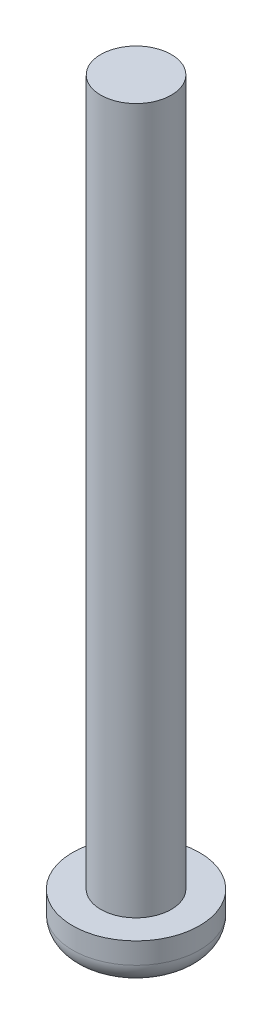
ISO-10303-21;
HEADER;
FILE_DESCRIPTION(('STEP AP214'),'2;1');
FILE_NAME('part.step','',(''),(''),'','','');
FILE_SCHEMA(('AUTOMOTIVE_DESIGN { 1 0 10303 214 1 1 1 1 }'));
ENDSEC;
DATA;
#1=APPLICATION_CONTEXT('core data for automotive mechanical design processes');
#2=APPLICATION_PROTOCOL_DEFINITION('international standard','automotive_design',2000,#1);
#3=PRODUCT_CONTEXT('',#1,'mechanical');
#4=PRODUCT('Part','Part','',(#3));
#5=PRODUCT_RELATED_PRODUCT_CATEGORY('part','',(#4));
#6=PRODUCT_DEFINITION_FORMATION('','',#4);
#7=PRODUCT_DEFINITION_CONTEXT('part definition',#1,'design');
#8=PRODUCT_DEFINITION('design','',#6,#7);
#9=PRODUCT_DEFINITION_SHAPE('','',#8);
#10=(LENGTH_UNIT() NAMED_UNIT(*) SI_UNIT(.MILLI.,.METRE.));
#11=(NAMED_UNIT(*) PLANE_ANGLE_UNIT() SI_UNIT($,.RADIAN.));
#12=(NAMED_UNIT(*) SI_UNIT($,.STERADIAN.) SOLID_ANGLE_UNIT());
#13=UNCERTAINTY_MEASURE_WITH_UNIT(LENGTH_MEASURE(1.E-05),#10,'distance_accuracy_value','');
#14=(GEOMETRIC_REPRESENTATION_CONTEXT(3) GLOBAL_UNCERTAINTY_ASSIGNED_CONTEXT((#13)) GLOBAL_UNIT_ASSIGNED_CONTEXT((#10,
#11,#12)) REPRESENTATION_CONTEXT('',''));
#15=CARTESIAN_POINT('',(0.,0.,0.));
#16=DIRECTION('',(0.,0.,1.));
#17=DIRECTION('',(1.,0.,0.));
#18=AXIS2_PLACEMENT_3D('',#15,#16,#17);
#19=CARTESIAN_POINT('',(0.,10.,0.));
#20=DIRECTION('',(0.,-1.,0.));
#21=DIRECTION('',(0.,0.,-1.));
#22=AXIS2_PLACEMENT_3D('',#19,#20,#21);
#23=CYLINDRICAL_SURFACE('',#22,0.5);
#24=CARTESIAN_POINT('',(0.,10.,0.));
#25=DIRECTION('',(0.,1.,0.));
#26=DIRECTION('',(0.,0.,1.));
#27=AXIS2_PLACEMENT_3D('',#24,#25,#26);
#28=CIRCLE('',#27,0.5);
#29=CARTESIAN_POINT('',(0.,10.,0.5));
#30=VERTEX_POINT('',#29);
#31=EDGE_CURVE('E46',#30,#30,#28,.T.);
#32=ORIENTED_EDGE('',*,*,#31,.F.);
#33=EDGE_LOOP('',(#32));
#34=FACE_BOUND('',#33,.T.);
#35=CARTESIAN_POINT('',(0.,0.,0.));
#36=DIRECTION('',(0.,1.,0.));
#37=DIRECTION('',(0.,0.,1.));
#38=AXIS2_PLACEMENT_3D('',#35,#36,#37);
#39=CIRCLE('',#38,0.5);
#40=CARTESIAN_POINT('',(0.,0.,0.5));
#41=VERTEX_POINT('',#40);
#42=EDGE_CURVE('E50',#41,#41,#39,.T.);
#43=ORIENTED_EDGE('',*,*,#42,.T.);
#44=EDGE_LOOP('',(#43));
#45=FACE_BOUND('',#44,.T.);
#46=ADVANCED_FACE('F35',(#34,#45),#23,.T.);
#47=CARTESIAN_POINT('',(0.,10.,0.));
#48=DIRECTION('',(0.,1.,0.));
#49=DIRECTION('',(0.,0.,1.));
#50=AXIS2_PLACEMENT_3D('',#47,#48,#49);
#51=PLANE('',#50);
#52=ORIENTED_EDGE('',*,*,#31,.T.);
#53=EDGE_LOOP('',(#52));
#54=FACE_BOUND('',#53,.T.);
#55=ADVANCED_FACE('F75',(#54),#51,.T.);
#56=CARTESIAN_POINT('',(0.,-0.6,0.));
#57=DIRECTION('',(0.,1.,0.));
#58=DIRECTION('',(0.,0.,1.));
#59=AXIS2_PLACEMENT_3D('',#56,#57,#58);
#60=CYLINDRICAL_SURFACE('',#59,0.9);
#61=CARTESIAN_POINT('',(0.,-0.3,0.));
#62=DIRECTION('',(0.,-1.,0.));
#63=DIRECTION('',(0.,0.,-1.));
#64=AXIS2_PLACEMENT_3D('',#61,#62,#63);
#65=CIRCLE('',#64,0.9);
#66=CARTESIAN_POINT('',(0.,-0.3,-0.9));
#67=VERTEX_POINT('',#66);
#68=EDGE_CURVE('E10',#67,#67,#65,.F.);
#69=ORIENTED_EDGE('',*,*,#68,.T.);
#70=EDGE_LOOP('',(#69));
#71=FACE_BOUND('',#70,.T.);
#72=CARTESIAN_POINT('',(0.,0.,0.));
#73=DIRECTION('',(0.,-1.,0.));
#74=DIRECTION('',(0.,0.,-1.));
#75=AXIS2_PLACEMENT_3D('',#72,#73,#74);
#76=CIRCLE('',#75,0.9);
#77=CARTESIAN_POINT('',(0.,0.,-0.9));
#78=VERTEX_POINT('',#77);
#79=EDGE_CURVE('E54',#78,#78,#76,.T.);
#80=ORIENTED_EDGE('',*,*,#79,.T.);
#81=EDGE_LOOP('',(#80));
#82=FACE_BOUND('',#81,.T.);
#83=ADVANCED_FACE('F59',(#71,#82),#60,.T.);
#84=CARTESIAN_POINT('',(0.,-0.6,0.));
#85=DIRECTION('',(0.,-1.,0.));
#86=DIRECTION('',(0.,0.,-1.));
#87=AXIS2_PLACEMENT_3D('',#84,#85,#86);
#88=PLANE('',#87);
#89=CARTESIAN_POINT('',(0.,-0.6,0.));
#90=DIRECTION('',(0.,-1.,0.));
#91=DIRECTION('',(0.,0.,-1.));
#92=AXIS2_PLACEMENT_3D('',#89,#90,#91);
#93=CIRCLE('',#92,0.6);
#94=CARTESIAN_POINT('',(0.,-0.6,-0.6));
#95=VERTEX_POINT('',#94);
#96=EDGE_CURVE('E42',#95,#95,#93,.T.);
#97=ORIENTED_EDGE('',*,*,#96,.T.);
#98=EDGE_LOOP('',(#97));
#99=FACE_BOUND('',#98,.T.);
#100=ADVANCED_FACE('F63',(#99),#88,.T.);
#101=CARTESIAN_POINT('',(0.,0.,0.));
#102=DIRECTION('',(0.,-1.,0.));
#103=DIRECTION('',(0.,0.,-1.));
#104=AXIS2_PLACEMENT_3D('',#101,#102,#103);
#105=PLANE('',#104);
#106=ORIENTED_EDGE('',*,*,#42,.F.);
#107=EDGE_LOOP('',(#106));
#108=FACE_BOUND('',#107,.T.);
#109=ORIENTED_EDGE('',*,*,#79,.F.);
#110=EDGE_LOOP('',(#109));
#111=FACE_BOUND('',#110,.T.);
#112=ADVANCED_FACE('F61',(#108,#111),#105,.F.);
#113=CARTESIAN_POINT('',(0.,-0.3,0.));
#114=DIRECTION('',(0.,-1.,0.));
#115=DIRECTION('',(0.,0.,-1.));
#116=AXIS2_PLACEMENT_3D('',#113,#114,#115);
#117=TOROIDAL_SURFACE('',#116,0.6,0.3);
#118=ORIENTED_EDGE('',*,*,#68,.F.);
#119=EDGE_LOOP('',(#118));
#120=FACE_BOUND('',#119,.T.);
#121=ORIENTED_EDGE('',*,*,#96,.F.);
#122=EDGE_LOOP('',(#121));
#123=FACE_BOUND('',#122,.T.);
#124=ADVANCED_FACE('F37',(#120,#123),#117,.T.);
#125=CLOSED_SHELL('',(#46,#55,#83,#100,#112,#124));
#126=MANIFOLD_SOLID_BREP('B2',#125);
#127=ADVANCED_BREP_SHAPE_REPRESENTATION('',(#18,#126),#14);
#128=SHAPE_DEFINITION_REPRESENTATION(#9,#127);
ENDSEC;
END-ISO-10303-21;
